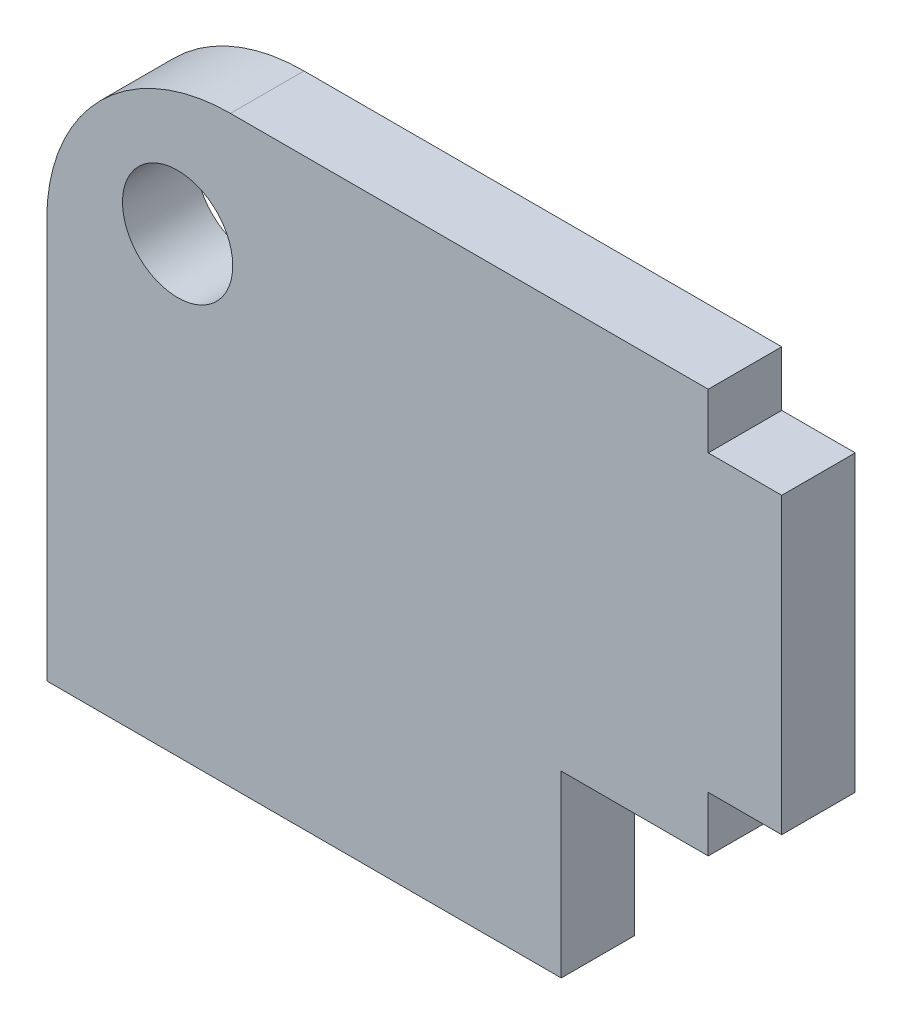
ISO-10303-21;
HEADER;
FILE_DESCRIPTION(('STEP AP214'),'2;1');
FILE_NAME('part.step','',(''),(''),'','','');
FILE_SCHEMA(('AUTOMOTIVE_DESIGN { 1 0 10303 214 1 1 1 1 }'));
ENDSEC;
DATA;
#1=APPLICATION_CONTEXT('core data for automotive mechanical design processes');
#2=APPLICATION_PROTOCOL_DEFINITION('international standard','automotive_design',2000,#1);
#3=PRODUCT_CONTEXT('',#1,'mechanical');
#4=PRODUCT('Part','Part','',(#3));
#5=PRODUCT_RELATED_PRODUCT_CATEGORY('part','',(#4));
#6=PRODUCT_DEFINITION_FORMATION('','',#4);
#7=PRODUCT_DEFINITION_CONTEXT('part definition',#1,'design');
#8=PRODUCT_DEFINITION('design','',#6,#7);
#9=PRODUCT_DEFINITION_SHAPE('','',#8);
#10=(LENGTH_UNIT() NAMED_UNIT(*) SI_UNIT(.MILLI.,.METRE.));
#11=(NAMED_UNIT(*) PLANE_ANGLE_UNIT() SI_UNIT($,.RADIAN.));
#12=(NAMED_UNIT(*) SI_UNIT($,.STERADIAN.) SOLID_ANGLE_UNIT());
#13=UNCERTAINTY_MEASURE_WITH_UNIT(LENGTH_MEASURE(1.E-05),#10,'distance_accuracy_value','');
#14=(GEOMETRIC_REPRESENTATION_CONTEXT(3) GLOBAL_UNCERTAINTY_ASSIGNED_CONTEXT((#13)) GLOBAL_UNIT_ASSIGNED_CONTEXT((#10,
#11,#12)) REPRESENTATION_CONTEXT('',''));
#15=CARTESIAN_POINT('',(0.,0.,0.));
#16=DIRECTION('',(0.,0.,1.));
#17=DIRECTION('',(1.,0.,0.));
#18=AXIS2_PLACEMENT_3D('',#15,#16,#17);
#19=CARTESIAN_POINT('',(-5.,2.93781329910027,2.));
#20=DIRECTION('',(0.,0.,-1.));
#21=DIRECTION('',(-1.,0.,0.));
#22=AXIS2_PLACEMENT_3D('',#19,#20,#21);
#23=PLANE('',#22);
#24=CARTESIAN_POINT('',(-5.,2.93781329910027,2.));
#25=DIRECTION('',(0.,0.,1.));
#26=DIRECTION('',(-1.,0.,0.));
#27=AXIS2_PLACEMENT_3D('',#24,#25,#26);
#28=CIRCLE('',#27,5.);
#29=CARTESIAN_POINT('',(-4.99999999999996,7.93781329910027,2.));
#30=VERTEX_POINT('',#29);
#31=CARTESIAN_POINT('',(-10.,2.93781329910024,2.));
#32=VERTEX_POINT('',#31);
#33=EDGE_CURVE('E168',#30,#32,#28,.T.);
#34=ORIENTED_EDGE('',*,*,#33,.T.);
#35=DIRECTION('',(0.,-1.,0.));
#36=VECTOR('',#35,1.);
#37=CARTESIAN_POINT('',(-10.,-7.93781329910027,2.));
#38=LINE('',#37,#36);
#39=CARTESIAN_POINT('',(-10.,-7.93781329910027,2.));
#40=VERTEX_POINT('',#39);
#41=EDGE_CURVE('E101',#32,#40,#38,.T.);
#42=ORIENTED_EDGE('',*,*,#41,.T.);
#43=DIRECTION('',(1.,0.,0.));
#44=VECTOR('',#43,1.);
#45=CARTESIAN_POINT('',(4.,-7.93781329910027,2.));
#46=LINE('',#45,#44);
#47=CARTESIAN_POINT('',(4.,-7.93781329910027,2.));
#48=VERTEX_POINT('',#47);
#49=EDGE_CURVE('E192',#40,#48,#46,.T.);
#50=ORIENTED_EDGE('',*,*,#49,.T.);
#51=DIRECTION('',(0.,1.,0.));
#52=VECTOR('',#51,1.);
#53=CARTESIAN_POINT('',(4.,-7.93781329910027,2.));
#54=LINE('',#53,#52);
#55=CARTESIAN_POINT('',(4.,-3.06218670089968,2.));
#56=VERTEX_POINT('',#55);
#57=EDGE_CURVE('E211',#48,#56,#54,.T.);
#58=ORIENTED_EDGE('',*,*,#57,.T.);
#59=DIRECTION('',(1.,0.,0.));
#60=VECTOR('',#59,1.);
#61=CARTESIAN_POINT('',(8.,-3.06218670089968,2.));
#62=LINE('',#61,#60);
#63=CARTESIAN_POINT('',(8.,-3.06218670089968,2.));
#64=VERTEX_POINT('',#63);
#65=EDGE_CURVE('E208',#56,#64,#62,.T.);
#66=ORIENTED_EDGE('',*,*,#65,.T.);
#67=DIRECTION('',(0.,1.,0.));
#68=VECTOR('',#67,1.);
#69=CARTESIAN_POINT('',(8.,-1.5621867008997,2.));
#70=LINE('',#69,#68);
#71=CARTESIAN_POINT('',(8.,-1.5621867008997,2.));
#72=VERTEX_POINT('',#71);
#73=EDGE_CURVE('E210',#64,#72,#70,.T.);
#74=ORIENTED_EDGE('',*,*,#73,.T.);
#75=DIRECTION('',(1.,0.,0.));
#76=VECTOR('',#75,1.);
#77=CARTESIAN_POINT('',(10.,-1.5621867008997,2.));
#78=LINE('',#77,#76);
#79=CARTESIAN_POINT('',(10.,-1.5621867008997,2.));
#80=VERTEX_POINT('',#79);
#81=EDGE_CURVE('E213',#72,#80,#78,.T.);
#82=ORIENTED_EDGE('',*,*,#81,.T.);
#83=DIRECTION('',(0.,1.,0.));
#84=VECTOR('',#83,1.);
#85=CARTESIAN_POINT('',(10.,6.4378132991003,2.));
#86=LINE('',#85,#84);
#87=CARTESIAN_POINT('',(10.,6.4378132991003,2.));
#88=VERTEX_POINT('',#87);
#89=EDGE_CURVE('E129',#80,#88,#86,.T.);
#90=ORIENTED_EDGE('',*,*,#89,.T.);
#91=DIRECTION('',(-1.,0.,0.));
#92=VECTOR('',#91,1.);
#93=CARTESIAN_POINT('',(10.,6.4378132991003,2.));
#94=LINE('',#93,#92);
#95=CARTESIAN_POINT('',(8.,6.4378132991003,2.));
#96=VERTEX_POINT('',#95);
#97=EDGE_CURVE('E123',#88,#96,#94,.T.);
#98=ORIENTED_EDGE('',*,*,#97,.T.);
#99=DIRECTION('',(0.,1.,0.));
#100=VECTOR('',#99,1.);
#101=CARTESIAN_POINT('',(8.,6.4378132991003,2.));
#102=LINE('',#101,#100);
#103=CARTESIAN_POINT('',(8.,7.93781329910027,2.));
#104=VERTEX_POINT('',#103);
#105=EDGE_CURVE('E127',#96,#104,#102,.T.);
#106=ORIENTED_EDGE('',*,*,#105,.T.);
#107=DIRECTION('',(-1.,0.,0.));
#108=VECTOR('',#107,1.);
#109=CARTESIAN_POINT('',(-4.99999999999996,7.93781329910027,2.));
#110=LINE('',#109,#108);
#111=EDGE_CURVE('E49',#104,#30,#110,.T.);
#112=ORIENTED_EDGE('',*,*,#111,.T.);
#113=EDGE_LOOP('',(#34,#42,#50,#58,#66,#74,#82,#90,#98,#106,#112));
#114=FACE_BOUND('',#113,.T.);
#115=CARTESIAN_POINT('',(-6.43933982822016,4.37715312732044,2.));
#116=DIRECTION('',(0.,0.,1.));
#117=DIRECTION('',(1.,0.,0.));
#118=AXIS2_PLACEMENT_3D('',#115,#116,#117);
#119=CIRCLE('',#118,1.5);
#120=CARTESIAN_POINT('',(-4.93933982822016,4.37715312732044,2.));
#121=VERTEX_POINT('',#120);
#122=EDGE_CURVE('E151',#121,#121,#119,.T.);
#123=ORIENTED_EDGE('',*,*,#122,.F.);
#124=EDGE_LOOP('',(#123));
#125=FACE_BOUND('',#124,.T.);
#126=ADVANCED_FACE('F32',(#114,#125),#23,.F.);
#127=CARTESIAN_POINT('',(-5.,2.93781329910027,0.));
#128=DIRECTION('',(0.,0.,-1.));
#129=DIRECTION('',(-1.,0.,0.));
#130=AXIS2_PLACEMENT_3D('',#127,#128,#129);
#131=PLANE('',#130);
#132=CARTESIAN_POINT('',(-5.,2.93781329910027,0.));
#133=DIRECTION('',(0.,0.,1.));
#134=DIRECTION('',(-1.,0.,0.));
#135=AXIS2_PLACEMENT_3D('',#132,#133,#134);
#136=CIRCLE('',#135,5.);
#137=CARTESIAN_POINT('',(-4.99999999999996,7.93781329910027,0.));
#138=VERTEX_POINT('',#137);
#139=CARTESIAN_POINT('',(-10.,2.93781329910024,0.));
#140=VERTEX_POINT('',#139);
#141=EDGE_CURVE('E147',#138,#140,#136,.T.);
#142=ORIENTED_EDGE('',*,*,#141,.F.);
#143=DIRECTION('',(-1.,0.,0.));
#144=VECTOR('',#143,1.);
#145=CARTESIAN_POINT('',(-4.99999999999996,7.93781329910027,0.));
#146=LINE('',#145,#144);
#147=CARTESIAN_POINT('',(8.,7.93781329910027,0.));
#148=VERTEX_POINT('',#147);
#149=EDGE_CURVE('E93',#148,#138,#146,.T.);
#150=ORIENTED_EDGE('',*,*,#149,.F.);
#151=DIRECTION('',(0.,1.,0.));
#152=VECTOR('',#151,1.);
#153=CARTESIAN_POINT('',(8.,6.4378132991003,0.));
#154=LINE('',#153,#152);
#155=CARTESIAN_POINT('',(8.,6.4378132991003,0.));
#156=VERTEX_POINT('',#155);
#157=EDGE_CURVE('E87',#156,#148,#154,.T.);
#158=ORIENTED_EDGE('',*,*,#157,.F.);
#159=DIRECTION('',(-1.,0.,0.));
#160=VECTOR('',#159,1.);
#161=CARTESIAN_POINT('',(10.,6.4378132991003,0.));
#162=LINE('',#161,#160);
#163=CARTESIAN_POINT('',(10.,6.4378132991003,0.));
#164=VERTEX_POINT('',#163);
#165=EDGE_CURVE('E137',#164,#156,#162,.T.);
#166=ORIENTED_EDGE('',*,*,#165,.F.);
#167=DIRECTION('',(0.,1.,0.));
#168=VECTOR('',#167,1.);
#169=CARTESIAN_POINT('',(10.,6.4378132991003,0.));
#170=LINE('',#169,#168);
#171=CARTESIAN_POINT('',(10.,-1.5621867008997,0.));
#172=VERTEX_POINT('',#171);
#173=EDGE_CURVE('E163',#172,#164,#170,.T.);
#174=ORIENTED_EDGE('',*,*,#173,.F.);
#175=DIRECTION('',(1.,0.,0.));
#176=VECTOR('',#175,1.);
#177=CARTESIAN_POINT('',(10.,-1.5621867008997,0.));
#178=LINE('',#177,#176);
#179=CARTESIAN_POINT('',(8.,-1.5621867008997,0.));
#180=VERTEX_POINT('',#179);
#181=EDGE_CURVE('E161',#180,#172,#178,.T.);
#182=ORIENTED_EDGE('',*,*,#181,.F.);
#183=DIRECTION('',(0.,1.,0.));
#184=VECTOR('',#183,1.);
#185=CARTESIAN_POINT('',(8.,-1.5621867008997,0.));
#186=LINE('',#185,#184);
#187=CARTESIAN_POINT('',(8.,-3.06218670089968,0.));
#188=VERTEX_POINT('',#187);
#189=EDGE_CURVE('E159',#188,#180,#186,.T.);
#190=ORIENTED_EDGE('',*,*,#189,.F.);
#191=DIRECTION('',(1.,0.,0.));
#192=VECTOR('',#191,1.);
#193=CARTESIAN_POINT('',(8.,-3.06218670089968,0.));
#194=LINE('',#193,#192);
#195=CARTESIAN_POINT('',(4.,-3.06218670089968,0.));
#196=VERTEX_POINT('',#195);
#197=EDGE_CURVE('E157',#196,#188,#194,.T.);
#198=ORIENTED_EDGE('',*,*,#197,.F.);
#199=DIRECTION('',(0.,1.,0.));
#200=VECTOR('',#199,1.);
#201=CARTESIAN_POINT('',(4.,-7.93781329910027,0.));
#202=LINE('',#201,#200);
#203=CARTESIAN_POINT('',(4.,-7.93781329910027,0.));
#204=VERTEX_POINT('',#203);
#205=EDGE_CURVE('E155',#204,#196,#202,.T.);
#206=ORIENTED_EDGE('',*,*,#205,.F.);
#207=DIRECTION('',(1.,0.,0.));
#208=VECTOR('',#207,1.);
#209=CARTESIAN_POINT('',(4.,-7.93781329910027,0.));
#210=LINE('',#209,#208);
#211=CARTESIAN_POINT('',(-10.,-7.93781329910027,0.));
#212=VERTEX_POINT('',#211);
#213=EDGE_CURVE('E153',#212,#204,#210,.T.);
#214=ORIENTED_EDGE('',*,*,#213,.F.);
#215=DIRECTION('',(0.,-1.,0.));
#216=VECTOR('',#215,1.);
#217=CARTESIAN_POINT('',(-10.,-7.93781329910027,0.));
#218=LINE('',#217,#216);
#219=EDGE_CURVE('E150',#140,#212,#218,.T.);
#220=ORIENTED_EDGE('',*,*,#219,.F.);
#221=EDGE_LOOP('',(#142,#150,#158,#166,#174,#182,#190,#198,#206,#214,#220));
#222=FACE_BOUND('',#221,.T.);
#223=CARTESIAN_POINT('',(-6.43933982822016,4.37715312732044,0.));
#224=DIRECTION('',(0.,0.,1.));
#225=DIRECTION('',(1.,0.,0.));
#226=AXIS2_PLACEMENT_3D('',#223,#224,#225);
#227=CIRCLE('',#226,1.5);
#228=CARTESIAN_POINT('',(-4.93933982822016,4.37715312732044,0.));
#229=VERTEX_POINT('',#228);
#230=EDGE_CURVE('E351',#229,#229,#227,.T.);
#231=ORIENTED_EDGE('',*,*,#230,.T.);
#232=EDGE_LOOP('',(#231));
#233=FACE_BOUND('',#232,.T.);
#234=ADVANCED_FACE('F196',(#222,#233),#131,.T.);
#235=CARTESIAN_POINT('',(-5.,2.93781329910027,2.));
#236=DIRECTION('',(0.,0.,-1.));
#237=DIRECTION('',(-1.,0.,0.));
#238=AXIS2_PLACEMENT_3D('',#235,#236,#237);
#239=CYLINDRICAL_SURFACE('',#238,5.);
#240=ORIENTED_EDGE('',*,*,#141,.T.);
#241=DIRECTION('',(0.,0.,-1.));
#242=VECTOR('',#241,1.);
#243=CARTESIAN_POINT('',(-10.,2.93781329910024,2.));
#244=LINE('',#243,#242);
#245=EDGE_CURVE('E11',#32,#140,#244,.T.);
#246=ORIENTED_EDGE('',*,*,#245,.F.);
#247=ORIENTED_EDGE('',*,*,#33,.F.);
#248=DIRECTION('',(0.,0.,-1.));
#249=VECTOR('',#248,1.);
#250=CARTESIAN_POINT('',(-4.99999999999996,7.93781329910027,2.));
#251=LINE('',#250,#249);
#252=EDGE_CURVE('E143',#30,#138,#251,.T.);
#253=ORIENTED_EDGE('',*,*,#252,.T.);
#254=EDGE_LOOP('',(#240,#246,#247,#253));
#255=FACE_BOUND('',#254,.T.);
#256=ADVANCED_FACE('F34',(#255),#239,.T.);
#257=CARTESIAN_POINT('',(-10.,-7.93781329910027,2.));
#258=DIRECTION('',(1.,0.,0.));
#259=DIRECTION('',(0.,0.,-1.));
#260=AXIS2_PLACEMENT_3D('',#257,#258,#259);
#261=PLANE('',#260);
#262=ORIENTED_EDGE('',*,*,#219,.T.);
#263=DIRECTION('',(0.,0.,-1.));
#264=VECTOR('',#263,1.);
#265=CARTESIAN_POINT('',(-10.,-7.93781329910027,2.));
#266=LINE('',#265,#264);
#267=EDGE_CURVE('E41',#40,#212,#266,.T.);
#268=ORIENTED_EDGE('',*,*,#267,.F.);
#269=ORIENTED_EDGE('',*,*,#41,.F.);
#270=ORIENTED_EDGE('',*,*,#245,.T.);
#271=EDGE_LOOP('',(#262,#268,#269,#270));
#272=FACE_BOUND('',#271,.T.);
#273=ADVANCED_FACE('F250',(#272),#261,.F.);
#274=CARTESIAN_POINT('',(4.,-7.93781329910027,2.));
#275=DIRECTION('',(0.,1.,0.));
#276=DIRECTION('',(0.,0.,1.));
#277=AXIS2_PLACEMENT_3D('',#274,#275,#276);
#278=PLANE('',#277);
#279=ORIENTED_EDGE('',*,*,#213,.T.);
#280=DIRECTION('',(0.,0.,-1.));
#281=VECTOR('',#280,1.);
#282=CARTESIAN_POINT('',(4.,-7.93781329910027,2.));
#283=LINE('',#282,#281);
#284=EDGE_CURVE('E184',#48,#204,#283,.T.);
#285=ORIENTED_EDGE('',*,*,#284,.F.);
#286=ORIENTED_EDGE('',*,*,#49,.F.);
#287=ORIENTED_EDGE('',*,*,#267,.T.);
#288=EDGE_LOOP('',(#279,#285,#286,#287));
#289=FACE_BOUND('',#288,.T.);
#290=ADVANCED_FACE('F190',(#289),#278,.F.);
#291=CARTESIAN_POINT('',(4.,-7.93781329910027,2.));
#292=DIRECTION('',(-1.,0.,0.));
#293=DIRECTION('',(0.,-1.,0.));
#294=AXIS2_PLACEMENT_3D('',#291,#292,#293);
#295=PLANE('',#294);
#296=ORIENTED_EDGE('',*,*,#205,.T.);
#297=DIRECTION('',(0.,0.,-1.));
#298=VECTOR('',#297,1.);
#299=CARTESIAN_POINT('',(4.,-3.06218670089968,2.));
#300=LINE('',#299,#298);
#301=EDGE_CURVE('E181',#56,#196,#300,.T.);
#302=ORIENTED_EDGE('',*,*,#301,.F.);
#303=ORIENTED_EDGE('',*,*,#57,.F.);
#304=ORIENTED_EDGE('',*,*,#284,.T.);
#305=EDGE_LOOP('',(#296,#302,#303,#304));
#306=FACE_BOUND('',#305,.T.);
#307=ADVANCED_FACE('F202',(#306),#295,.F.);
#308=CARTESIAN_POINT('',(8.,-3.06218670089968,2.));
#309=DIRECTION('',(0.,1.,0.));
#310=DIRECTION('',(-1.,0.,0.));
#311=AXIS2_PLACEMENT_3D('',#308,#309,#310);
#312=PLANE('',#311);
#313=ORIENTED_EDGE('',*,*,#197,.T.);
#314=DIRECTION('',(0.,0.,-1.));
#315=VECTOR('',#314,1.);
#316=CARTESIAN_POINT('',(8.,-3.06218670089968,2.));
#317=LINE('',#316,#315);
#318=EDGE_CURVE('E178',#64,#188,#317,.T.);
#319=ORIENTED_EDGE('',*,*,#318,.F.);
#320=ORIENTED_EDGE('',*,*,#65,.F.);
#321=ORIENTED_EDGE('',*,*,#301,.T.);
#322=EDGE_LOOP('',(#313,#319,#320,#321));
#323=FACE_BOUND('',#322,.T.);
#324=ADVANCED_FACE('F206',(#323),#312,.F.);
#325=CARTESIAN_POINT('',(8.,-1.5621867008997,2.));
#326=DIRECTION('',(-1.,0.,0.));
#327=DIRECTION('',(0.,0.,1.));
#328=AXIS2_PLACEMENT_3D('',#325,#326,#327);
#329=PLANE('',#328);
#330=ORIENTED_EDGE('',*,*,#189,.T.);
#331=DIRECTION('',(0.,0.,-1.));
#332=VECTOR('',#331,1.);
#333=CARTESIAN_POINT('',(8.,-1.5621867008997,2.));
#334=LINE('',#333,#332);
#335=EDGE_CURVE('E175',#72,#180,#334,.T.);
#336=ORIENTED_EDGE('',*,*,#335,.F.);
#337=ORIENTED_EDGE('',*,*,#73,.F.);
#338=ORIENTED_EDGE('',*,*,#318,.T.);
#339=EDGE_LOOP('',(#330,#336,#337,#338));
#340=FACE_BOUND('',#339,.T.);
#341=ADVANCED_FACE('F263',(#340),#329,.F.);
#342=CARTESIAN_POINT('',(10.,-1.5621867008997,2.));
#343=DIRECTION('',(0.,1.,0.));
#344=DIRECTION('',(-1.,0.,0.));
#345=AXIS2_PLACEMENT_3D('',#342,#343,#344);
#346=PLANE('',#345);
#347=ORIENTED_EDGE('',*,*,#181,.T.);
#348=DIRECTION('',(0.,0.,-1.));
#349=VECTOR('',#348,1.);
#350=CARTESIAN_POINT('',(10.,-1.5621867008997,2.));
#351=LINE('',#350,#349);
#352=EDGE_CURVE('E172',#80,#172,#351,.T.);
#353=ORIENTED_EDGE('',*,*,#352,.F.);
#354=ORIENTED_EDGE('',*,*,#81,.F.);
#355=ORIENTED_EDGE('',*,*,#335,.T.);
#356=EDGE_LOOP('',(#347,#353,#354,#355));
#357=FACE_BOUND('',#356,.T.);
#358=ADVANCED_FACE('F222',(#357),#346,.F.);
#359=CARTESIAN_POINT('',(10.,6.4378132991003,2.));
#360=DIRECTION('',(-1.,0.,0.));
#361=DIRECTION('',(0.,-1.,0.));
#362=AXIS2_PLACEMENT_3D('',#359,#360,#361);
#363=PLANE('',#362);
#364=ORIENTED_EDGE('',*,*,#173,.T.);
#365=DIRECTION('',(0.,0.,-1.));
#366=VECTOR('',#365,1.);
#367=CARTESIAN_POINT('',(10.,6.4378132991003,2.));
#368=LINE('',#367,#366);
#369=EDGE_CURVE('E138',#88,#164,#368,.T.);
#370=ORIENTED_EDGE('',*,*,#369,.F.);
#371=ORIENTED_EDGE('',*,*,#89,.F.);
#372=ORIENTED_EDGE('',*,*,#352,.T.);
#373=EDGE_LOOP('',(#364,#370,#371,#372));
#374=FACE_BOUND('',#373,.T.);
#375=ADVANCED_FACE('F226',(#374),#363,.F.);
#376=CARTESIAN_POINT('',(10.,6.4378132991003,2.));
#377=DIRECTION('',(0.,-1.,0.));
#378=DIRECTION('',(0.,0.,-1.));
#379=AXIS2_PLACEMENT_3D('',#376,#377,#378);
#380=PLANE('',#379);
#381=ORIENTED_EDGE('',*,*,#165,.T.);
#382=DIRECTION('',(0.,0.,-1.));
#383=VECTOR('',#382,1.);
#384=CARTESIAN_POINT('',(8.,6.4378132991003,2.));
#385=LINE('',#384,#383);
#386=EDGE_CURVE('E134',#96,#156,#385,.T.);
#387=ORIENTED_EDGE('',*,*,#386,.F.);
#388=ORIENTED_EDGE('',*,*,#97,.F.);
#389=ORIENTED_EDGE('',*,*,#369,.T.);
#390=EDGE_LOOP('',(#381,#387,#388,#389));
#391=FACE_BOUND('',#390,.T.);
#392=ADVANCED_FACE('F135',(#391),#380,.F.);
#393=CARTESIAN_POINT('',(8.,6.4378132991003,2.));
#394=DIRECTION('',(-1.,0.,0.));
#395=DIRECTION('',(0.,0.,1.));
#396=AXIS2_PLACEMENT_3D('',#393,#394,#395);
#397=PLANE('',#396);
#398=ORIENTED_EDGE('',*,*,#157,.T.);
#399=DIRECTION('',(0.,0.,-1.));
#400=VECTOR('',#399,1.);
#401=CARTESIAN_POINT('',(8.,7.93781329910027,2.));
#402=LINE('',#401,#400);
#403=EDGE_CURVE('E139',#104,#148,#402,.T.);
#404=ORIENTED_EDGE('',*,*,#403,.F.);
#405=ORIENTED_EDGE('',*,*,#105,.F.);
#406=ORIENTED_EDGE('',*,*,#386,.T.);
#407=EDGE_LOOP('',(#398,#404,#405,#406));
#408=FACE_BOUND('',#407,.T.);
#409=ADVANCED_FACE('F141',(#408),#397,.F.);
#410=CARTESIAN_POINT('',(-4.99999999999996,7.93781329910027,2.));
#411=DIRECTION('',(0.,-1.,0.));
#412=DIRECTION('',(0.,0.,-1.));
#413=AXIS2_PLACEMENT_3D('',#410,#411,#412);
#414=PLANE('',#413);
#415=ORIENTED_EDGE('',*,*,#149,.T.);
#416=ORIENTED_EDGE('',*,*,#252,.F.);
#417=ORIENTED_EDGE('',*,*,#111,.F.);
#418=ORIENTED_EDGE('',*,*,#403,.T.);
#419=EDGE_LOOP('',(#415,#416,#417,#418));
#420=FACE_BOUND('',#419,.T.);
#421=ADVANCED_FACE('F230',(#420),#414,.F.);
#422=CARTESIAN_POINT('',(-6.43933982822016,4.37715312732044,2.));
#423=DIRECTION('',(0.,0.,-1.));
#424=DIRECTION('',(-1.,0.,0.));
#425=AXIS2_PLACEMENT_3D('',#422,#423,#424);
#426=CYLINDRICAL_SURFACE('',#425,1.5);
#427=ORIENTED_EDGE('',*,*,#122,.T.);
#428=EDGE_LOOP('',(#427));
#429=FACE_BOUND('',#428,.T.);
#430=ORIENTED_EDGE('',*,*,#230,.F.);
#431=EDGE_LOOP('',(#430));
#432=FACE_BOUND('',#431,.T.);
#433=ADVANCED_FACE('F232',(#429,#432),#426,.F.);
#434=CLOSED_SHELL('',(#126,#234,#256,#273,#290,#307,#324,#341,#358,#375,#392,#409,#421,#433));
#435=MANIFOLD_SOLID_BREP('B2',#434);
#436=ADVANCED_BREP_SHAPE_REPRESENTATION('',(#18,#435),#14);
#437=SHAPE_DEFINITION_REPRESENTATION(#9,#436);
ENDSEC;
END-ISO-10303-21;
